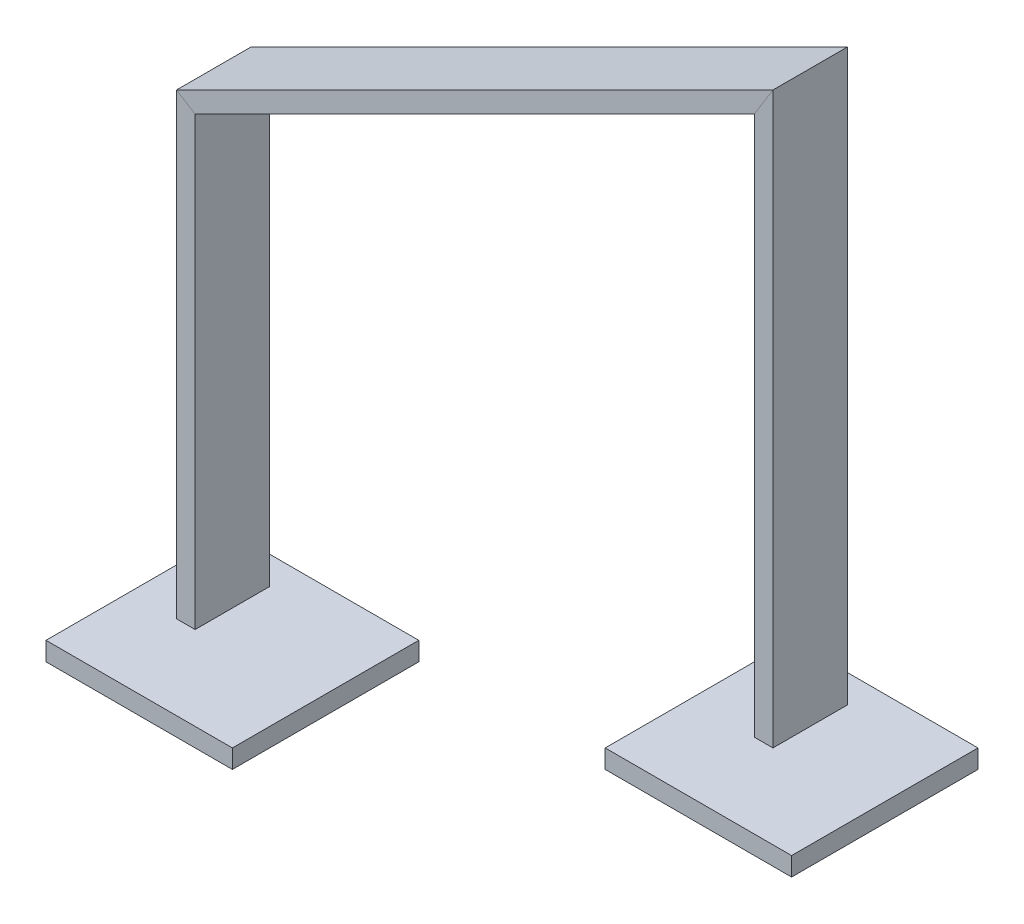
ISO-10303-21;
HEADER;
FILE_DESCRIPTION(('STEP AP214'),'2;1');
FILE_NAME('part.step','',(''),(''),'','','');
FILE_SCHEMA(('AUTOMOTIVE_DESIGN { 1 0 10303 214 1 1 1 1 }'));
ENDSEC;
DATA;
#1=APPLICATION_CONTEXT('core data for automotive mechanical design processes');
#2=APPLICATION_PROTOCOL_DEFINITION('international standard','automotive_design',2000,#1);
#3=PRODUCT_CONTEXT('',#1,'mechanical');
#4=PRODUCT('Part','Part','',(#3));
#5=PRODUCT_RELATED_PRODUCT_CATEGORY('part','',(#4));
#6=PRODUCT_DEFINITION_FORMATION('','',#4);
#7=PRODUCT_DEFINITION_CONTEXT('part definition',#1,'design');
#8=PRODUCT_DEFINITION('design','',#6,#7);
#9=PRODUCT_DEFINITION_SHAPE('','',#8);
#10=(LENGTH_UNIT() NAMED_UNIT(*) SI_UNIT(.MILLI.,.METRE.));
#11=(NAMED_UNIT(*) PLANE_ANGLE_UNIT() SI_UNIT($,.RADIAN.));
#12=(NAMED_UNIT(*) SI_UNIT($,.STERADIAN.) SOLID_ANGLE_UNIT());
#13=UNCERTAINTY_MEASURE_WITH_UNIT(LENGTH_MEASURE(1.E-05),#10,'distance_accuracy_value','');
#14=(GEOMETRIC_REPRESENTATION_CONTEXT(3) GLOBAL_UNCERTAINTY_ASSIGNED_CONTEXT((#13)) GLOBAL_UNIT_ASSIGNED_CONTEXT((#10,
#11,#12)) REPRESENTATION_CONTEXT('',''));
#15=CARTESIAN_POINT('',(0.,0.,0.));
#16=DIRECTION('',(0.,0.,1.));
#17=DIRECTION('',(1.,0.,0.));
#18=AXIS2_PLACEMENT_3D('',#15,#16,#17);
#19=CARTESIAN_POINT('',(400.,125.,0.));
#20=DIRECTION('',(0.,-1.,0.));
#21=DIRECTION('',(0.,0.,1.));
#22=AXIS2_PLACEMENT_3D('',#19,#20,#21);
#23=PLANE('',#22);
#24=DIRECTION('',(0.,0.,-1.));
#25=VECTOR('',#24,1.);
#26=CARTESIAN_POINT('',(350.,125.,20.));
#27=LINE('',#26,#25);
#28=CARTESIAN_POINT('',(350.,125.,20.));
#29=VERTEX_POINT('',#28);
#30=CARTESIAN_POINT('',(350.,125.,-20.));
#31=VERTEX_POINT('',#30);
#32=EDGE_CURVE('E94',#29,#31,#27,.T.);
#33=ORIENTED_EDGE('',*,*,#32,.T.);
#34=DIRECTION('',(1.,0.,0.));
#35=VECTOR('',#34,1.);
#36=CARTESIAN_POINT('',(350.,125.,-20.));
#37=LINE('',#36,#35);
#38=CARTESIAN_POINT('',(360.,125.,-20.));
#39=VERTEX_POINT('',#38);
#40=EDGE_CURVE('E113',#31,#39,#37,.T.);
#41=ORIENTED_EDGE('',*,*,#40,.T.);
#42=DIRECTION('',(0.,0.,1.));
#43=VECTOR('',#42,1.);
#44=CARTESIAN_POINT('',(360.,125.,20.));
#45=LINE('',#44,#43);
#46=CARTESIAN_POINT('',(360.,125.,20.));
#47=VERTEX_POINT('',#46);
#48=EDGE_CURVE('E99',#39,#47,#45,.T.);
#49=ORIENTED_EDGE('',*,*,#48,.T.);
#50=DIRECTION('',(-1.,0.,0.));
#51=VECTOR('',#50,1.);
#52=CARTESIAN_POINT('',(350.,125.,20.));
#53=LINE('',#52,#51);
#54=EDGE_CURVE('E97',#47,#29,#53,.T.);
#55=ORIENTED_EDGE('',*,*,#54,.T.);
#56=EDGE_LOOP('',(#33,#41,#49,#55));
#57=FACE_BOUND('',#56,.T.);
#58=ADVANCED_FACE('F48',(#57),#23,.T.);
#59=CARTESIAN_POINT('',(0.,25.,0.));
#60=DIRECTION('',(0.,1.,0.));
#61=DIRECTION('',(0.,0.,1.));
#62=AXIS2_PLACEMENT_3D('',#59,#60,#61);
#63=PLANE('',#62);
#64=DIRECTION('',(0.,0.,-1.));
#65=VECTOR('',#64,1.);
#66=CARTESIAN_POINT('',(50.,25.,20.));
#67=LINE('',#66,#65);
#68=CARTESIAN_POINT('',(50.,25.,20.));
#69=VERTEX_POINT('',#68);
#70=CARTESIAN_POINT('',(50.,25.,-20.));
#71=VERTEX_POINT('',#70);
#72=EDGE_CURVE('E145',#69,#71,#67,.T.);
#73=ORIENTED_EDGE('',*,*,#72,.F.);
#74=DIRECTION('',(1.,0.,0.));
#75=VECTOR('',#74,1.);
#76=CARTESIAN_POINT('',(50.,25.,20.));
#77=LINE('',#76,#75);
#78=CARTESIAN_POINT('',(40.,25.,20.));
#79=VERTEX_POINT('',#78);
#80=EDGE_CURVE('E151',#79,#69,#77,.T.);
#81=ORIENTED_EDGE('',*,*,#80,.F.);
#82=DIRECTION('',(0.,0.,1.));
#83=VECTOR('',#82,1.);
#84=CARTESIAN_POINT('',(40.,25.,20.));
#85=LINE('',#84,#83);
#86=CARTESIAN_POINT('',(40.,25.,-20.));
#87=VERTEX_POINT('',#86);
#88=EDGE_CURVE('E155',#87,#79,#85,.T.);
#89=ORIENTED_EDGE('',*,*,#88,.F.);
#90=DIRECTION('',(-1.,0.,0.));
#91=VECTOR('',#90,1.);
#92=CARTESIAN_POINT('',(50.,25.,-20.));
#93=LINE('',#92,#91);
#94=EDGE_CURVE('E161',#71,#87,#93,.T.);
#95=ORIENTED_EDGE('',*,*,#94,.F.);
#96=EDGE_LOOP('',(#73,#81,#89,#95));
#97=FACE_BOUND('',#96,.T.);
#98=ADVANCED_FACE('F194',(#97),#63,.F.);
#99=CARTESIAN_POINT('',(350.,432.406871063722,20.));
#100=DIRECTION('',(-1.,0.,0.));
#101=DIRECTION('',(0.,-1.,0.));
#102=AXIS2_PLACEMENT_3D('',#99,#100,#101);
#103=PLANE('',#102);
#104=DIRECTION('',(0.,0.,1.));
#105=VECTOR('',#104,1.);
#106=CARTESIAN_POINT('',(350.,414.508497187474,20.0000000000001));
#107=LINE('',#106,#105);
#108=CARTESIAN_POINT('',(350.,414.508497187473,-20.));
#109=VERTEX_POINT('',#108);
#110=CARTESIAN_POINT('',(350.,414.508497187473,20.));
#111=VERTEX_POINT('',#110);
#112=EDGE_CURVE('E129',#109,#111,#107,.T.);
#113=ORIENTED_EDGE('',*,*,#112,.F.);
#114=DIRECTION('',(0.,-1.,0.));
#115=VECTOR('',#114,1.);
#116=CARTESIAN_POINT('',(350.,432.406871063722,-20.));
#117=LINE('',#116,#115);
#118=EDGE_CURVE('E111',#109,#31,#117,.T.);
#119=ORIENTED_EDGE('',*,*,#118,.T.);
#120=ORIENTED_EDGE('',*,*,#32,.F.);
#121=DIRECTION('',(0.,-1.,0.));
#122=VECTOR('',#121,1.);
#123=CARTESIAN_POINT('',(350.,432.406871063722,20.));
#124=LINE('',#123,#122);
#125=EDGE_CURVE('E51',#111,#29,#124,.T.);
#126=ORIENTED_EDGE('',*,*,#125,.F.);
#127=EDGE_LOOP('',(#113,#119,#120,#126));
#128=FACE_BOUND('',#127,.T.);
#129=ADVANCED_FACE('F108',(#128),#103,.T.);
#130=CARTESIAN_POINT('',(350.,432.406871063722,-20.));
#131=DIRECTION('',(0.,0.,-1.));
#132=DIRECTION('',(-1.,0.,0.));
#133=AXIS2_PLACEMENT_3D('',#130,#131,#132);
#134=PLANE('',#133);
#135=DIRECTION('',(-0.525731112119133,-0.85065080835204,0.));
#136=VECTOR('',#135,1.);
#137=CARTESIAN_POINT('',(196.9149534157,166.811688644715,-19.9999999999998));
#138=LINE('',#137,#136);
#139=CARTESIAN_POINT('',(360.,430.688837074972,-20.));
#140=VERTEX_POINT('',#139);
#141=EDGE_CURVE('E142',#140,#109,#138,.T.);
#142=ORIENTED_EDGE('',*,*,#141,.F.);
#143=DIRECTION('',(0.,-1.,0.));
#144=VECTOR('',#143,1.);
#145=CARTESIAN_POINT('',(360.,432.406871063722,-20.));
#146=LINE('',#145,#144);
#147=EDGE_CURVE('E122',#140,#39,#146,.T.);
#148=ORIENTED_EDGE('',*,*,#147,.T.);
#149=ORIENTED_EDGE('',*,*,#40,.F.);
#150=ORIENTED_EDGE('',*,*,#118,.F.);
#151=EDGE_LOOP('',(#142,#148,#149,#150));
#152=FACE_BOUND('',#151,.T.);
#153=ADVANCED_FACE('F214',(#152),#134,.T.);
#154=CARTESIAN_POINT('',(360.,432.406871063722,20.));
#155=DIRECTION('',(1.,0.,0.));
#156=DIRECTION('',(0.,1.,0.));
#157=AXIS2_PLACEMENT_3D('',#154,#155,#156);
#158=PLANE('',#157);
#159=DIRECTION('',(0.,0.,-1.));
#160=VECTOR('',#159,1.);
#161=CARTESIAN_POINT('',(360.,430.688837074973,20.0000000000001));
#162=LINE('',#161,#160);
#163=CARTESIAN_POINT('',(360.,430.688837074972,20.));
#164=VERTEX_POINT('',#163);
#165=EDGE_CURVE('E139',#164,#140,#162,.T.);
#166=ORIENTED_EDGE('',*,*,#165,.F.);
#167=DIRECTION('',(0.,-1.,0.));
#168=VECTOR('',#167,1.);
#169=CARTESIAN_POINT('',(360.,432.406871063722,20.));
#170=LINE('',#169,#168);
#171=EDGE_CURVE('E112',#164,#47,#170,.T.);
#172=ORIENTED_EDGE('',*,*,#171,.T.);
#173=ORIENTED_EDGE('',*,*,#48,.F.);
#174=ORIENTED_EDGE('',*,*,#147,.F.);
#175=EDGE_LOOP('',(#166,#172,#173,#174));
#176=FACE_BOUND('',#175,.T.);
#177=ADVANCED_FACE('F216',(#176),#158,.T.);
#178=CARTESIAN_POINT('',(350.,432.406871063722,20.));
#179=DIRECTION('',(0.,0.,1.));
#180=DIRECTION('',(1.,0.,0.));
#181=AXIS2_PLACEMENT_3D('',#178,#179,#180);
#182=PLANE('',#181);
#183=DIRECTION('',(0.525731112119133,0.85065080835204,0.));
#184=VECTOR('',#183,1.);
#185=CARTESIAN_POINT('',(196.9149534157,166.811688644715,19.9999999999999));
#186=LINE('',#185,#184);
#187=EDGE_CURVE('E117',#111,#164,#186,.T.);
#188=ORIENTED_EDGE('',*,*,#187,.F.);
#189=ORIENTED_EDGE('',*,*,#125,.T.);
#190=ORIENTED_EDGE('',*,*,#54,.F.);
#191=ORIENTED_EDGE('',*,*,#171,.F.);
#192=EDGE_LOOP('',(#188,#189,#190,#191));
#193=FACE_BOUND('',#192,.T.);
#194=ADVANCED_FACE('F115',(#193),#182,.T.);
#195=CARTESIAN_POINT('',(43.8299068313996,261.423450603173,20.));
#196=DIRECTION('',(0.,0.,1.));
#197=DIRECTION('',(0.,-1.,0.));
#198=AXIS2_PLACEMENT_3D('',#195,#196,#197);
#199=PLANE('',#198);
#200=DIRECTION('',(0.894427190999916,0.447213595499958,0.));
#201=VECTOR('',#200,1.);
#202=CARTESIAN_POINT('',(43.8299068313996,261.423450603173,20.));
#203=LINE('',#202,#201);
#204=CARTESIAN_POINT('',(50.,264.508497187474,20.));
#205=VERTEX_POINT('',#204);
#206=EDGE_CURVE('E131',#205,#111,#203,.T.);
#207=ORIENTED_EDGE('',*,*,#206,.T.);
#208=ORIENTED_EDGE('',*,*,#187,.T.);
#209=DIRECTION('',(0.894427190999916,0.447213595499958,0.));
#210=VECTOR('',#209,1.);
#211=CARTESIAN_POINT('',(39.3577708764,270.367722513173,20.));
#212=LINE('',#211,#210);
#213=CARTESIAN_POINT('',(40.,270.688837074973,20.));
#214=VERTEX_POINT('',#213);
#215=EDGE_CURVE('E118',#214,#164,#212,.T.);
#216=ORIENTED_EDGE('',*,*,#215,.F.);
#217=DIRECTION('',(-0.85065080835204,0.525731112119134,0.));
#218=VECTOR('',#217,1.);
#219=CARTESIAN_POINT('',(157.111456180002,198.309976683738,20.));
#220=LINE('',#219,#218);
#221=EDGE_CURVE('E149',#205,#214,#220,.T.);
#222=ORIENTED_EDGE('',*,*,#221,.F.);
#223=EDGE_LOOP('',(#207,#208,#216,#222));
#224=FACE_BOUND('',#223,.T.);
#225=ADVANCED_FACE('F218',(#224),#199,.T.);
#226=CARTESIAN_POINT('',(39.3577708764,270.367722513173,20.));
#227=DIRECTION('',(-0.447213595499958,0.894427190999916,0.));
#228=DIRECTION('',(-0.894427190999916,-0.447213595499958,0.));
#229=AXIS2_PLACEMENT_3D('',#226,#227,#228);
#230=PLANE('',#229);
#231=ORIENTED_EDGE('',*,*,#215,.T.);
#232=ORIENTED_EDGE('',*,*,#165,.T.);
#233=DIRECTION('',(0.894427190999916,0.447213595499958,0.));
#234=VECTOR('',#233,1.);
#235=CARTESIAN_POINT('',(39.3577708764,270.367722513173,-20.));
#236=LINE('',#235,#234);
#237=CARTESIAN_POINT('',(40.,270.688837074973,-20.));
#238=VERTEX_POINT('',#237);
#239=EDGE_CURVE('E120',#238,#140,#236,.T.);
#240=ORIENTED_EDGE('',*,*,#239,.F.);
#241=DIRECTION('',(0.,0.,-1.));
#242=VECTOR('',#241,1.);
#243=CARTESIAN_POINT('',(40.,270.688837074973,20.));
#244=LINE('',#243,#242);
#245=EDGE_CURVE('E57',#214,#238,#244,.T.);
#246=ORIENTED_EDGE('',*,*,#245,.F.);
#247=EDGE_LOOP('',(#231,#232,#240,#246));
#248=FACE_BOUND('',#247,.T.);
#249=ADVANCED_FACE('F217',(#248),#230,.T.);
#250=CARTESIAN_POINT('',(43.8299068313996,261.423450603173,-20.));
#251=DIRECTION('',(0.,0.,-1.));
#252=DIRECTION('',(0.,1.,0.));
#253=AXIS2_PLACEMENT_3D('',#250,#251,#252);
#254=PLANE('',#253);
#255=ORIENTED_EDGE('',*,*,#239,.T.);
#256=ORIENTED_EDGE('',*,*,#141,.T.);
#257=DIRECTION('',(0.894427190999916,0.447213595499958,0.));
#258=VECTOR('',#257,1.);
#259=CARTESIAN_POINT('',(43.8299068313996,261.423450603173,-20.));
#260=LINE('',#259,#258);
#261=CARTESIAN_POINT('',(50.,264.508497187474,-20.));
#262=VERTEX_POINT('',#261);
#263=EDGE_CURVE('E134',#262,#109,#260,.T.);
#264=ORIENTED_EDGE('',*,*,#263,.F.);
#265=DIRECTION('',(0.85065080835204,-0.525731112119134,0.));
#266=VECTOR('',#265,1.);
#267=CARTESIAN_POINT('',(157.111456180002,198.309976683738,-19.9999999999999));
#268=LINE('',#267,#266);
#269=EDGE_CURVE('E12',#238,#262,#268,.T.);
#270=ORIENTED_EDGE('',*,*,#269,.F.);
#271=EDGE_LOOP('',(#255,#256,#264,#270));
#272=FACE_BOUND('',#271,.T.);
#273=ADVANCED_FACE('F211',(#272),#254,.T.);
#274=CARTESIAN_POINT('',(43.8299068313996,261.423450603173,20.));
#275=DIRECTION('',(0.447213595499958,-0.894427190999916,0.));
#276=DIRECTION('',(0.894427190999916,0.447213595499958,0.));
#277=AXIS2_PLACEMENT_3D('',#274,#275,#276);
#278=PLANE('',#277);
#279=ORIENTED_EDGE('',*,*,#263,.T.);
#280=ORIENTED_EDGE('',*,*,#112,.T.);
#281=ORIENTED_EDGE('',*,*,#206,.F.);
#282=DIRECTION('',(0.,0.,1.));
#283=VECTOR('',#282,1.);
#284=CARTESIAN_POINT('',(50.,264.508497187474,20.));
#285=LINE('',#284,#283);
#286=EDGE_CURVE('E146',#262,#205,#285,.T.);
#287=ORIENTED_EDGE('',*,*,#286,.F.);
#288=EDGE_LOOP('',(#279,#280,#281,#287));
#289=FACE_BOUND('',#288,.T.);
#290=ADVANCED_FACE('F210',(#289),#278,.T.);
#291=CARTESIAN_POINT('',(50.,25.,20.));
#292=DIRECTION('',(0.,0.,1.));
#293=DIRECTION('',(1.,0.,0.));
#294=AXIS2_PLACEMENT_3D('',#291,#292,#293);
#295=PLANE('',#294);
#296=DIRECTION('',(0.,1.,0.));
#297=VECTOR('',#296,1.);
#298=CARTESIAN_POINT('',(50.,25.,20.));
#299=LINE('',#298,#297);
#300=EDGE_CURVE('E154',#69,#205,#299,.T.);
#301=ORIENTED_EDGE('',*,*,#300,.T.);
#302=ORIENTED_EDGE('',*,*,#221,.T.);
#303=DIRECTION('',(0.,1.,0.));
#304=VECTOR('',#303,1.);
#305=CARTESIAN_POINT('',(40.,25.,20.));
#306=LINE('',#305,#304);
#307=EDGE_CURVE('E150',#79,#214,#306,.T.);
#308=ORIENTED_EDGE('',*,*,#307,.F.);
#309=ORIENTED_EDGE('',*,*,#80,.T.);
#310=EDGE_LOOP('',(#301,#302,#308,#309));
#311=FACE_BOUND('',#310,.T.);
#312=ADVANCED_FACE('F203',(#311),#295,.T.);
#313=CARTESIAN_POINT('',(40.,25.,20.));
#314=DIRECTION('',(-1.,0.,0.));
#315=DIRECTION('',(0.,0.,1.));
#316=AXIS2_PLACEMENT_3D('',#313,#314,#315);
#317=PLANE('',#316);
#318=ORIENTED_EDGE('',*,*,#307,.T.);
#319=ORIENTED_EDGE('',*,*,#245,.T.);
#320=DIRECTION('',(0.,1.,0.));
#321=VECTOR('',#320,1.);
#322=CARTESIAN_POINT('',(40.,25.,-20.));
#323=LINE('',#322,#321);
#324=EDGE_CURVE('E158',#87,#238,#323,.T.);
#325=ORIENTED_EDGE('',*,*,#324,.F.);
#326=ORIENTED_EDGE('',*,*,#88,.T.);
#327=EDGE_LOOP('',(#318,#319,#325,#326));
#328=FACE_BOUND('',#327,.T.);
#329=ADVANCED_FACE('F178',(#328),#317,.T.);
#330=CARTESIAN_POINT('',(50.,25.,-20.));
#331=DIRECTION('',(0.,0.,-1.));
#332=DIRECTION('',(-1.,0.,0.));
#333=AXIS2_PLACEMENT_3D('',#330,#331,#332);
#334=PLANE('',#333);
#335=ORIENTED_EDGE('',*,*,#324,.T.);
#336=ORIENTED_EDGE('',*,*,#269,.T.);
#337=DIRECTION('',(0.,1.,0.));
#338=VECTOR('',#337,1.);
#339=CARTESIAN_POINT('',(50.,25.,-20.));
#340=LINE('',#339,#338);
#341=EDGE_CURVE('E164',#71,#262,#340,.T.);
#342=ORIENTED_EDGE('',*,*,#341,.F.);
#343=ORIENTED_EDGE('',*,*,#94,.T.);
#344=EDGE_LOOP('',(#335,#336,#342,#343));
#345=FACE_BOUND('',#344,.T.);
#346=ADVANCED_FACE('F184',(#345),#334,.T.);
#347=CARTESIAN_POINT('',(50.,25.,20.));
#348=DIRECTION('',(1.,0.,0.));
#349=DIRECTION('',(0.,0.,-1.));
#350=AXIS2_PLACEMENT_3D('',#347,#348,#349);
#351=PLANE('',#350);
#352=ORIENTED_EDGE('',*,*,#341,.T.);
#353=ORIENTED_EDGE('',*,*,#286,.T.);
#354=ORIENTED_EDGE('',*,*,#300,.F.);
#355=ORIENTED_EDGE('',*,*,#72,.T.);
#356=EDGE_LOOP('',(#352,#353,#354,#355));
#357=FACE_BOUND('',#356,.T.);
#358=ADVANCED_FACE('F199',(#357),#351,.T.);
#359=CLOSED_SHELL('',(#58,#98,#129,#153,#177,#194,#225,#249,#273,#290,#312,#329,#346,#358));
#360=MANIFOLD_SOLID_BREP('B2',#359);
#361=CARTESIAN_POINT('',(300.,100.,50.));
#362=DIRECTION('',(1.,0.,0.));
#363=DIRECTION('',(0.,0.,-1.));
#364=AXIS2_PLACEMENT_3D('',#361,#362,#363);
#365=PLANE('',#364);
#366=DIRECTION('',(0.,-1.,0.));
#367=VECTOR('',#366,1.);
#368=CARTESIAN_POINT('',(300.,100.,-50.));
#369=LINE('',#368,#367);
#370=CARTESIAN_POINT('',(300.,110.,-50.));
#371=VERTEX_POINT('',#370);
#372=CARTESIAN_POINT('',(300.,100.,-50.));
#373=VERTEX_POINT('',#372);
#374=EDGE_CURVE('E403',#371,#373,#369,.T.);
#375=ORIENTED_EDGE('',*,*,#374,.T.);
#376=DIRECTION('',(0.,0.,-1.));
#377=VECTOR('',#376,1.);
#378=CARTESIAN_POINT('',(300.,100.,50.));
#379=LINE('',#378,#377);
#380=CARTESIAN_POINT('',(300.,100.,50.));
#381=VERTEX_POINT('',#380);
#382=EDGE_CURVE('E46',#381,#373,#379,.T.);
#383=ORIENTED_EDGE('',*,*,#382,.F.);
#384=DIRECTION('',(0.,-1.,0.));
#385=VECTOR('',#384,1.);
#386=CARTESIAN_POINT('',(300.,100.,50.));
#387=LINE('',#386,#385);
#388=CARTESIAN_POINT('',(300.,110.,50.));
#389=VERTEX_POINT('',#388);
#390=EDGE_CURVE('E391',#389,#381,#387,.T.);
#391=ORIENTED_EDGE('',*,*,#390,.F.);
#392=DIRECTION('',(0.,0.,-1.));
#393=VECTOR('',#392,1.);
#394=CARTESIAN_POINT('',(300.,110.,50.));
#395=LINE('',#394,#393);
#396=EDGE_CURVE('E399',#389,#371,#395,.T.);
#397=ORIENTED_EDGE('',*,*,#396,.T.);
#398=EDGE_LOOP('',(#375,#383,#391,#397));
#399=FACE_BOUND('',#398,.T.);
#400=ADVANCED_FACE('F340',(#399),#365,.F.);
#401=CARTESIAN_POINT('',(300.,100.,50.));
#402=DIRECTION('',(0.,1.,0.));
#403=DIRECTION('',(0.,0.,1.));
#404=AXIS2_PLACEMENT_3D('',#401,#402,#403);
#405=PLANE('',#404);
#406=DIRECTION('',(1.,0.,0.));
#407=VECTOR('',#406,1.);
#408=CARTESIAN_POINT('',(300.,100.,-50.));
#409=LINE('',#408,#407);
#410=CARTESIAN_POINT('',(400.,100.,-50.));
#411=VERTEX_POINT('',#410);
#412=EDGE_CURVE('E395',#373,#411,#409,.T.);
#413=ORIENTED_EDGE('',*,*,#412,.T.);
#414=DIRECTION('',(0.,0.,-1.));
#415=VECTOR('',#414,1.);
#416=CARTESIAN_POINT('',(400.,100.,50.));
#417=LINE('',#416,#415);
#418=CARTESIAN_POINT('',(400.,100.,50.));
#419=VERTEX_POINT('',#418);
#420=EDGE_CURVE('E348',#419,#411,#417,.T.);
#421=ORIENTED_EDGE('',*,*,#420,.F.);
#422=DIRECTION('',(1.,0.,0.));
#423=VECTOR('',#422,1.);
#424=CARTESIAN_POINT('',(300.,100.,50.));
#425=LINE('',#424,#423);
#426=EDGE_CURVE('E386',#381,#419,#425,.T.);
#427=ORIENTED_EDGE('',*,*,#426,.F.);
#428=ORIENTED_EDGE('',*,*,#382,.T.);
#429=EDGE_LOOP('',(#413,#421,#427,#428));
#430=FACE_BOUND('',#429,.T.);
#431=ADVANCED_FACE('F394',(#430),#405,.F.);
#432=CARTESIAN_POINT('',(400.,100.,50.));
#433=DIRECTION('',(-1.,0.,0.));
#434=DIRECTION('',(0.,0.,1.));
#435=AXIS2_PLACEMENT_3D('',#432,#433,#434);
#436=PLANE('',#435);
#437=DIRECTION('',(0.,1.,0.));
#438=VECTOR('',#437,1.);
#439=CARTESIAN_POINT('',(400.,100.,-50.));
#440=LINE('',#439,#438);
#441=CARTESIAN_POINT('',(400.,110.,-50.));
#442=VERTEX_POINT('',#441);
#443=EDGE_CURVE('E373',#411,#442,#440,.T.);
#444=ORIENTED_EDGE('',*,*,#443,.T.);
#445=DIRECTION('',(0.,0.,-1.));
#446=VECTOR('',#445,1.);
#447=CARTESIAN_POINT('',(400.,110.,50.));
#448=LINE('',#447,#446);
#449=CARTESIAN_POINT('',(400.,110.,50.));
#450=VERTEX_POINT('',#449);
#451=EDGE_CURVE('E396',#450,#442,#448,.T.);
#452=ORIENTED_EDGE('',*,*,#451,.F.);
#453=DIRECTION('',(0.,1.,0.));
#454=VECTOR('',#453,1.);
#455=CARTESIAN_POINT('',(400.,100.,50.));
#456=LINE('',#455,#454);
#457=EDGE_CURVE('E389',#419,#450,#456,.T.);
#458=ORIENTED_EDGE('',*,*,#457,.F.);
#459=ORIENTED_EDGE('',*,*,#420,.T.);
#460=EDGE_LOOP('',(#444,#452,#458,#459));
#461=FACE_BOUND('',#460,.T.);
#462=ADVANCED_FACE('F397',(#461),#436,.F.);
#463=CARTESIAN_POINT('',(300.,110.,50.));
#464=DIRECTION('',(0.,-1.,0.));
#465=DIRECTION('',(0.,0.,-1.));
#466=AXIS2_PLACEMENT_3D('',#463,#464,#465);
#467=PLANE('',#466);
#468=DIRECTION('',(-1.,0.,0.));
#469=VECTOR('',#468,1.);
#470=CARTESIAN_POINT('',(300.,110.,-50.));
#471=LINE('',#470,#469);
#472=EDGE_CURVE('E379',#442,#371,#471,.T.);
#473=ORIENTED_EDGE('',*,*,#472,.T.);
#474=ORIENTED_EDGE('',*,*,#396,.F.);
#475=DIRECTION('',(-1.,0.,0.));
#476=VECTOR('',#475,1.);
#477=CARTESIAN_POINT('',(300.,110.,50.));
#478=LINE('',#477,#476);
#479=EDGE_CURVE('E356',#450,#389,#478,.T.);
#480=ORIENTED_EDGE('',*,*,#479,.F.);
#481=ORIENTED_EDGE('',*,*,#451,.T.);
#482=EDGE_LOOP('',(#473,#474,#480,#481));
#483=FACE_BOUND('',#482,.T.);
#484=ADVANCED_FACE('F410',(#483),#467,.F.);
#485=CARTESIAN_POINT('',(0.,0.,50.));
#486=DIRECTION('',(0.,0.,-1.));
#487=DIRECTION('',(-1.,0.,0.));
#488=AXIS2_PLACEMENT_3D('',#485,#486,#487);
#489=PLANE('',#488);
#490=ORIENTED_EDGE('',*,*,#390,.T.);
#491=ORIENTED_EDGE('',*,*,#426,.T.);
#492=ORIENTED_EDGE('',*,*,#457,.T.);
#493=ORIENTED_EDGE('',*,*,#479,.T.);
#494=EDGE_LOOP('',(#490,#491,#492,#493));
#495=FACE_BOUND('',#494,.T.);
#496=ADVANCED_FACE('F387',(#495),#489,.F.);
#497=CARTESIAN_POINT('',(0.,0.,-50.));
#498=DIRECTION('',(0.,0.,-1.));
#499=DIRECTION('',(-1.,0.,0.));
#500=AXIS2_PLACEMENT_3D('',#497,#498,#499);
#501=PLANE('',#500);
#502=ORIENTED_EDGE('',*,*,#374,.F.);
#503=ORIENTED_EDGE('',*,*,#472,.F.);
#504=ORIENTED_EDGE('',*,*,#443,.F.);
#505=ORIENTED_EDGE('',*,*,#412,.F.);
#506=EDGE_LOOP('',(#502,#503,#504,#505));
#507=FACE_BOUND('',#506,.T.);
#508=ADVANCED_FACE('F413',(#507),#501,.T.);
#509=CLOSED_SHELL('',(#400,#431,#462,#484,#496,#508));
#510=MANIFOLD_SOLID_BREP('B6',#509);
#511=CARTESIAN_POINT('',(0.,10.,50.));
#512=DIRECTION('',(1.,0.,0.));
#513=DIRECTION('',(0.,0.,-1.));
#514=AXIS2_PLACEMENT_3D('',#511,#512,#513);
#515=PLANE('',#514);
#516=DIRECTION('',(0.,0.,1.));
#517=VECTOR('',#516,1.);
#518=CARTESIAN_POINT('',(0.,0.,50.));
#519=LINE('',#518,#517);
#520=CARTESIAN_POINT('',(0.,0.,-50.));
#521=VERTEX_POINT('',#520);
#522=CARTESIAN_POINT('',(0.,0.,50.));
#523=VERTEX_POINT('',#522);
#524=EDGE_CURVE('E526',#521,#523,#519,.T.);
#525=ORIENTED_EDGE('',*,*,#524,.T.);
#526=DIRECTION('',(0.,-1.,0.));
#527=VECTOR('',#526,1.);
#528=CARTESIAN_POINT('',(0.,10.,50.));
#529=LINE('',#528,#527);
#530=CARTESIAN_POINT('',(0.,10.,50.));
#531=VERTEX_POINT('',#530);
#532=EDGE_CURVE('E338',#531,#523,#529,.T.);
#533=ORIENTED_EDGE('',*,*,#532,.F.);
#534=DIRECTION('',(0.,0.,1.));
#535=VECTOR('',#534,1.);
#536=CARTESIAN_POINT('',(0.,10.,50.));
#537=LINE('',#536,#535);
#538=CARTESIAN_POINT('',(0.,10.,-50.));
#539=VERTEX_POINT('',#538);
#540=EDGE_CURVE('E514',#539,#531,#537,.T.);
#541=ORIENTED_EDGE('',*,*,#540,.F.);
#542=DIRECTION('',(0.,-1.,0.));
#543=VECTOR('',#542,1.);
#544=CARTESIAN_POINT('',(0.,10.,-50.));
#545=LINE('',#544,#543);
#546=EDGE_CURVE('E522',#539,#521,#545,.T.);
#547=ORIENTED_EDGE('',*,*,#546,.T.);
#548=EDGE_LOOP('',(#525,#533,#541,#547));
#549=FACE_BOUND('',#548,.T.);
#550=ADVANCED_FACE('F463',(#549),#515,.F.);
#551=CARTESIAN_POINT('',(0.,10.,50.));
#552=DIRECTION('',(0.,0.,-1.));
#553=DIRECTION('',(-1.,0.,0.));
#554=AXIS2_PLACEMENT_3D('',#551,#552,#553);
#555=PLANE('',#554);
#556=DIRECTION('',(1.,0.,0.));
#557=VECTOR('',#556,1.);
#558=CARTESIAN_POINT('',(0.,0.,50.));
#559=LINE('',#558,#557);
#560=CARTESIAN_POINT('',(100.,0.,50.));
#561=VERTEX_POINT('',#560);
#562=EDGE_CURVE('E518',#523,#561,#559,.T.);
#563=ORIENTED_EDGE('',*,*,#562,.T.);
#564=DIRECTION('',(0.,-1.,0.));
#565=VECTOR('',#564,1.);
#566=CARTESIAN_POINT('',(100.,10.,50.));
#567=LINE('',#566,#565);
#568=CARTESIAN_POINT('',(100.,10.,50.));
#569=VERTEX_POINT('',#568);
#570=EDGE_CURVE('E471',#569,#561,#567,.T.);
#571=ORIENTED_EDGE('',*,*,#570,.F.);
#572=DIRECTION('',(1.,0.,0.));
#573=VECTOR('',#572,1.);
#574=CARTESIAN_POINT('',(0.,10.,50.));
#575=LINE('',#574,#573);
#576=EDGE_CURVE('E509',#531,#569,#575,.T.);
#577=ORIENTED_EDGE('',*,*,#576,.F.);
#578=ORIENTED_EDGE('',*,*,#532,.T.);
#579=EDGE_LOOP('',(#563,#571,#577,#578));
#580=FACE_BOUND('',#579,.T.);
#581=ADVANCED_FACE('F517',(#580),#555,.F.);
#582=CARTESIAN_POINT('',(100.,10.,50.));
#583=DIRECTION('',(-1.,0.,0.));
#584=DIRECTION('',(0.,0.,1.));
#585=AXIS2_PLACEMENT_3D('',#582,#583,#584);
#586=PLANE('',#585);
#587=DIRECTION('',(0.,0.,-1.));
#588=VECTOR('',#587,1.);
#589=CARTESIAN_POINT('',(100.,0.,50.));
#590=LINE('',#589,#588);
#591=CARTESIAN_POINT('',(100.,0.,-50.));
#592=VERTEX_POINT('',#591);
#593=EDGE_CURVE('E496',#561,#592,#590,.T.);
#594=ORIENTED_EDGE('',*,*,#593,.T.);
#595=DIRECTION('',(0.,-1.,0.));
#596=VECTOR('',#595,1.);
#597=CARTESIAN_POINT('',(100.,10.,-50.));
#598=LINE('',#597,#596);
#599=CARTESIAN_POINT('',(100.,10.,-50.));
#600=VERTEX_POINT('',#599);
#601=EDGE_CURVE('E519',#600,#592,#598,.T.);
#602=ORIENTED_EDGE('',*,*,#601,.F.);
#603=DIRECTION('',(0.,0.,-1.));
#604=VECTOR('',#603,1.);
#605=CARTESIAN_POINT('',(100.,10.,50.));
#606=LINE('',#605,#604);
#607=EDGE_CURVE('E512',#569,#600,#606,.T.);
#608=ORIENTED_EDGE('',*,*,#607,.F.);
#609=ORIENTED_EDGE('',*,*,#570,.T.);
#610=EDGE_LOOP('',(#594,#602,#608,#609));
#611=FACE_BOUND('',#610,.T.);
#612=ADVANCED_FACE('F520',(#611),#586,.F.);
#613=CARTESIAN_POINT('',(0.,10.,-50.));
#614=DIRECTION('',(0.,0.,1.));
#615=DIRECTION('',(1.,0.,0.));
#616=AXIS2_PLACEMENT_3D('',#613,#614,#615);
#617=PLANE('',#616);
#618=DIRECTION('',(-1.,0.,0.));
#619=VECTOR('',#618,1.);
#620=CARTESIAN_POINT('',(0.,0.,-50.));
#621=LINE('',#620,#619);
#622=EDGE_CURVE('E502',#592,#521,#621,.T.);
#623=ORIENTED_EDGE('',*,*,#622,.T.);
#624=ORIENTED_EDGE('',*,*,#546,.F.);
#625=DIRECTION('',(-1.,0.,0.));
#626=VECTOR('',#625,1.);
#627=CARTESIAN_POINT('',(0.,10.,-50.));
#628=LINE('',#627,#626);
#629=EDGE_CURVE('E479',#600,#539,#628,.T.);
#630=ORIENTED_EDGE('',*,*,#629,.F.);
#631=ORIENTED_EDGE('',*,*,#601,.T.);
#632=EDGE_LOOP('',(#623,#624,#630,#631));
#633=FACE_BOUND('',#632,.T.);
#634=ADVANCED_FACE('F533',(#633),#617,.F.);
#635=CARTESIAN_POINT('',(0.,10.,0.));
#636=DIRECTION('',(0.,-1.,0.));
#637=DIRECTION('',(0.,0.,-1.));
#638=AXIS2_PLACEMENT_3D('',#635,#636,#637);
#639=PLANE('',#638);
#640=ORIENTED_EDGE('',*,*,#540,.T.);
#641=ORIENTED_EDGE('',*,*,#576,.T.);
#642=ORIENTED_EDGE('',*,*,#607,.T.);
#643=ORIENTED_EDGE('',*,*,#629,.T.);
#644=EDGE_LOOP('',(#640,#641,#642,#643));
#645=FACE_BOUND('',#644,.T.);
#646=ADVANCED_FACE('F510',(#645),#639,.F.);
#647=CARTESIAN_POINT('',(0.,0.,0.));
#648=DIRECTION('',(0.,-1.,0.));
#649=DIRECTION('',(0.,0.,-1.));
#650=AXIS2_PLACEMENT_3D('',#647,#648,#649);
#651=PLANE('',#650);
#652=ORIENTED_EDGE('',*,*,#524,.F.);
#653=ORIENTED_EDGE('',*,*,#622,.F.);
#654=ORIENTED_EDGE('',*,*,#593,.F.);
#655=ORIENTED_EDGE('',*,*,#562,.F.);
#656=EDGE_LOOP('',(#652,#653,#654,#655));
#657=FACE_BOUND('',#656,.T.);
#658=ADVANCED_FACE('F536',(#657),#651,.T.);
#659=CLOSED_SHELL('',(#550,#581,#612,#634,#646,#658));
#660=MANIFOLD_SOLID_BREP('B40',#659);
#661=ADVANCED_BREP_SHAPE_REPRESENTATION('',(#18,#360,#510,#660),#14);
#662=SHAPE_DEFINITION_REPRESENTATION(#9,#661);
ENDSEC;
END-ISO-10303-21;
